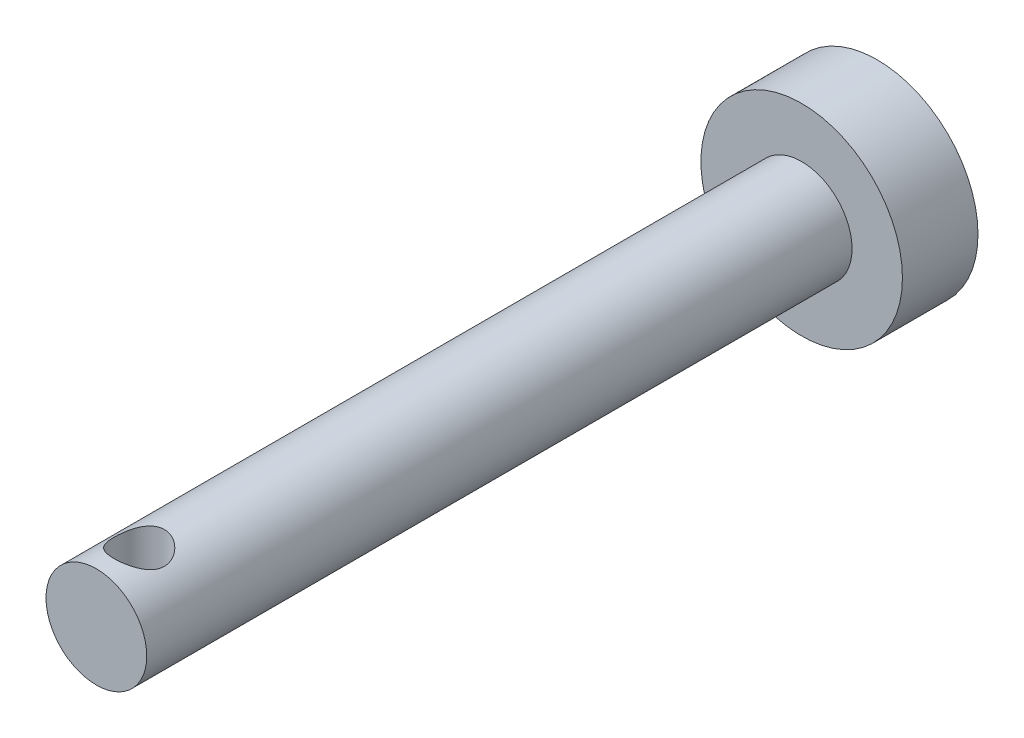
ISO-10303-21;
HEADER;
FILE_DESCRIPTION(('STEP AP214'),'2;1');
FILE_NAME('part.step','',(''),(''),'','','');
FILE_SCHEMA(('AUTOMOTIVE_DESIGN { 1 0 10303 214 1 1 1 1 }'));
ENDSEC;
DATA;
#1=APPLICATION_CONTEXT('core data for automotive mechanical design processes');
#2=APPLICATION_PROTOCOL_DEFINITION('international standard','automotive_design',2000,#1);
#3=PRODUCT_CONTEXT('',#1,'mechanical');
#4=PRODUCT('Part','Part','',(#3));
#5=PRODUCT_RELATED_PRODUCT_CATEGORY('part','',(#4));
#6=PRODUCT_DEFINITION_FORMATION('','',#4);
#7=PRODUCT_DEFINITION_CONTEXT('part definition',#1,'design');
#8=PRODUCT_DEFINITION('design','',#6,#7);
#9=PRODUCT_DEFINITION_SHAPE('','',#8);
#10=(LENGTH_UNIT() NAMED_UNIT(*) SI_UNIT(.MILLI.,.METRE.));
#11=(NAMED_UNIT(*) PLANE_ANGLE_UNIT() SI_UNIT($,.RADIAN.));
#12=(NAMED_UNIT(*) SI_UNIT($,.STERADIAN.) SOLID_ANGLE_UNIT());
#13=UNCERTAINTY_MEASURE_WITH_UNIT(LENGTH_MEASURE(1.E-05),#10,'distance_accuracy_value','');
#14=(GEOMETRIC_REPRESENTATION_CONTEXT(3) GLOBAL_UNCERTAINTY_ASSIGNED_CONTEXT((#13)) GLOBAL_UNIT_ASSIGNED_CONTEXT((#10,
#11,#12)) REPRESENTATION_CONTEXT('',''));
#15=CARTESIAN_POINT('',(0.,0.,0.));
#16=DIRECTION('',(0.,0.,1.));
#17=DIRECTION('',(1.,0.,0.));
#18=AXIS2_PLACEMENT_3D('',#15,#16,#17);
#19=CARTESIAN_POINT('',(0.,0.,-125.));
#20=DIRECTION('',(0.,0.,1.));
#21=DIRECTION('',(1.,0.,0.));
#22=AXIS2_PLACEMENT_3D('',#19,#20,#21);
#23=PLANE('',#22);
#24=CARTESIAN_POINT('',(0.,0.,-125.));
#25=DIRECTION('',(0.,0.,1.));
#26=DIRECTION('',(1.,0.,0.));
#27=AXIS2_PLACEMENT_3D('',#24,#25,#26);
#28=CIRCLE('',#27,4.);
#29=CARTESIAN_POINT('',(4.,0.,-125.));
#30=VERTEX_POINT('',#29);
#31=EDGE_CURVE('E10',#30,#30,#28,.T.);
#32=ORIENTED_EDGE('',*,*,#31,.F.);
#33=EDGE_LOOP('',(#32));
#34=FACE_BOUND('',#33,.T.);
#35=ADVANCED_FACE('F31',(#34),#23,.F.);
#36=CARTESIAN_POINT('',(0.,0.,125.));
#37=DIRECTION('',(0.,0.,1.));
#38=DIRECTION('',(1.,0.,0.));
#39=AXIS2_PLACEMENT_3D('',#36,#37,#38);
#40=CYLINDRICAL_SURFACE('',#39,4.);
#41=CARTESIAN_POINT('',(0.,0.,-122.));
#42=DIRECTION('',(0.,0.,1.));
#43=DIRECTION('',(1.,0.,0.));
#44=AXIS2_PLACEMENT_3D('',#41,#42,#43);
#45=CIRCLE('',#44,4.);
#46=CARTESIAN_POINT('',(4.,0.,-122.));
#47=VERTEX_POINT('',#46);
#48=EDGE_CURVE('E43',#47,#47,#45,.T.);
#49=ORIENTED_EDGE('',*,*,#48,.F.);
#50=EDGE_LOOP('',(#49));
#51=FACE_BOUND('',#50,.T.);
#52=ORIENTED_EDGE('',*,*,#31,.T.);
#53=EDGE_LOOP('',(#52));
#54=FACE_BOUND('',#53,.T.);
#55=ADVANCED_FACE('F79',(#51,#54),#40,.T.);
#56=CARTESIAN_POINT('',(0.,4.,-122.));
#57=DIRECTION('',(0.,0.,-1.));
#58=DIRECTION('',(-1.,0.,0.));
#59=AXIS2_PLACEMENT_3D('',#56,#57,#58);
#60=PLANE('',#59);
#61=CARTESIAN_POINT('',(0.,0.,-122.));
#62=DIRECTION('',(0.,0.,1.));
#63=DIRECTION('',(1.,0.,0.));
#64=AXIS2_PLACEMENT_3D('',#61,#62,#63);
#65=CIRCLE('',#64,2.00000000000003);
#66=CARTESIAN_POINT('',(2.00000000000003,0.,-122.));
#67=VERTEX_POINT('',#66);
#68=EDGE_CURVE('E48',#67,#67,#65,.T.);
#69=ORIENTED_EDGE('',*,*,#68,.F.);
#70=EDGE_LOOP('',(#69));
#71=FACE_BOUND('',#70,.T.);
#72=ORIENTED_EDGE('',*,*,#48,.T.);
#73=EDGE_LOOP('',(#72));
#74=FACE_BOUND('',#73,.T.);
#75=ADVANCED_FACE('F75',(#71,#74),#60,.F.);
#76=CARTESIAN_POINT('',(0.,0.,125.));
#77=DIRECTION('',(0.,0.,1.));
#78=DIRECTION('',(1.,0.,0.));
#79=AXIS2_PLACEMENT_3D('',#76,#77,#78);
#80=CYLINDRICAL_SURFACE('',#79,2.00000000000002);
#81=CARTESIAN_POINT('',(0.,-2.00000000000002,-94.7));
#82=CARTESIAN_POINT('',(0.0525719629529861,-1.99999713404152,-94.7000033023195));
#83=CARTESIAN_POINT('',(0.105206599698032,-1.99790491019519,-94.7041700731217));
#84=CARTESIAN_POINT('',(0.208920235268424,-1.98974156037398,-94.7206528803409));
#85=CARTESIAN_POINT('',(0.259996086713503,-1.98366287828985,-94.7329843929976));
#86=CARTESIAN_POINT('',(0.358933544880574,-1.96816279403313,-94.7651938086168));
#87=CARTESIAN_POINT('',(0.406806802939178,-1.95875439177522,-94.785042384248));
#88=CARTESIAN_POINT('',(0.498472616806563,-1.9374577651578,-94.8315706213649));
#89=CARTESIAN_POINT('',(0.542265493990048,-1.92556973633532,-94.8582497442489));
#90=CARTESIAN_POINT('',(0.62750781776192,-1.89956258258059,-94.9195172494853));
#91=CARTESIAN_POINT('',(0.668655211122115,-1.88535199127537,-94.9544864792396));
#92=CARTESIAN_POINT('',(0.744779444866981,-1.85659970246746,-95.030521479247));
#93=CARTESIAN_POINT('',(0.779751583106767,-1.84205776209037,-95.0715918517724));
#94=CARTESIAN_POINT('',(0.845252000450278,-1.81298951197349,-95.1624833495234));
#95=CARTESIAN_POINT('',(0.875225335551638,-1.79855186970133,-95.2127360983459));
#96=CARTESIAN_POINT('',(0.926168226890698,-1.77285978772322,-95.3183673359862));
#97=CARTESIAN_POINT('',(0.947144214966336,-1.76160307606991,-95.3737421287227));
#98=CARTESIAN_POINT('',(0.978132442188591,-1.7445786703781,-95.4846651054219));
#99=CARTESIAN_POINT('',(0.988725857080443,-1.73852271583715,-95.5400044520674));
#100=CARTESIAN_POINT('',(1.00042699330885,-1.73181889948529,-95.6519788377795));
#101=CARTESIAN_POINT('',(1.00154408837308,-1.7311656934329,-95.7086125408712));
#102=CARTESIAN_POINT('',(0.994687287172293,-1.7351093025725,-95.8142860243154));
#103=CARTESIAN_POINT('',(0.987784559536819,-1.73908763662015,-95.863424031223));
#104=CARTESIAN_POINT('',(0.966939849056931,-1.75076228733852,-95.959721909373));
#105=CARTESIAN_POINT('',(0.952995623897653,-1.75845978831778,-96.0068811453053));
#106=CARTESIAN_POINT('',(0.918209780386007,-1.77687476412743,-96.0992291325657));
#107=CARTESIAN_POINT('',(0.897215067115996,-1.78765840664,-96.1443463987858));
#108=CARTESIAN_POINT('',(0.849041687668001,-1.81103404281405,-96.23063429259));
#109=CARTESIAN_POINT('',(0.821860243812466,-1.82362684780192,-96.2718031356001));
#110=CARTESIAN_POINT('',(0.758066054912789,-1.85113157903287,-96.3545212527432));
#111=CARTESIAN_POINT('',(0.720694458369284,-1.86613510236748,-96.3954568735762));
#112=CARTESIAN_POINT('',(0.639555578741373,-1.89547623300409,-96.4707354185909));
#113=CARTESIAN_POINT('',(0.595785256574281,-1.90981351958803,-96.5050751920339));
#114=CARTESIAN_POINT('',(0.500516505831843,-1.93701987282966,-96.5676856610297));
#115=CARTESIAN_POINT('',(0.448753591599406,-1.94978984162009,-96.5956004724457));
#116=CARTESIAN_POINT('',(0.340466215488797,-1.97157881121244,-96.642097029043));
#117=CARTESIAN_POINT('',(0.283945576265277,-1.98060078943554,-96.6606861850152));
#118=CARTESIAN_POINT('',(0.172766491660702,-1.99324333741438,-96.6864754037167));
#119=CARTESIAN_POINT('',(0.118341530548324,-1.99724938301313,-96.6944912357468));
#120=CARTESIAN_POINT('',(0.00877959994935263,-2.00073013459103,-96.7014647311345));
#121=CARTESIAN_POINT('',(-0.0463570198699035,-2.00020698721314,-96.7004266856395));
#122=CARTESIAN_POINT('',(-0.151232971985996,-1.99491192253442,-96.6897933115812));
#123=CARTESIAN_POINT('',(-0.201059408049955,-1.99047245688191,-96.68086746727));
#124=CARTESIAN_POINT('',(-0.298406892301917,-1.9782217131482,-96.6557619281049));
#125=CARTESIAN_POINT('',(-0.345927685690998,-1.97041006334334,-96.6395814335466));
#126=CARTESIAN_POINT('',(-0.438888608449671,-1.95184251413671,-96.6000015335668));
#127=CARTESIAN_POINT('',(-0.484230397006162,-1.94100881769941,-96.5764089498832));
#128=CARTESIAN_POINT('',(-0.570461361698928,-1.9174397431711,-96.5228924643539));
#129=CARTESIAN_POINT('',(-0.611348629775286,-1.90470355565787,-96.4929658654066));
#130=CARTESIAN_POINT('',(-0.691767689290655,-1.87708221337466,-96.4242395746671));
#131=CARTESIAN_POINT('',(-0.730772077824641,-1.86210884848443,-96.3848571315464));
#132=CARTESIAN_POINT('',(-0.801856321113242,-1.83262391603876,-96.3000748487307));
#133=CARTESIAN_POINT('',(-0.833931385690844,-1.81811267381528,-96.2546708811836));
#134=CARTESIAN_POINT('',(-0.891707914497697,-1.7905119222607,-96.1563563457997));
#135=CARTESIAN_POINT('',(-0.917025495878638,-1.77752529663474,-96.1031887337914));
#136=CARTESIAN_POINT('',(-0.958082826013803,-1.75574072368128,-95.9924899323075));
#137=CARTESIAN_POINT('',(-0.97383491588757,-1.7469373824062,-95.9349644734988));
#138=CARTESIAN_POINT('',(-0.993861687449679,-1.73561501008669,-95.8230897771385));
#139=CARTESIAN_POINT('',(-0.999092996400865,-1.73257383460493,-95.768965746571));
#140=CARTESIAN_POINT('',(-1.00068915438079,-1.73165354646177,-95.6605529328293));
#141=CARTESIAN_POINT('',(-0.9970578466244,-1.73377219627554,-95.6062642312606));
#142=CARTESIAN_POINT('',(-0.981926125592264,-1.74237862050026,-95.504516498468));
#143=CARTESIAN_POINT('',(-0.9712083143428,-1.74843094482395,-95.4568995298556));
#144=CARTESIAN_POINT('',(-0.943175358224643,-1.76371016187919,-95.3641918805753));
#145=CARTESIAN_POINT('',(-0.925858091159808,-1.77293807569677,-95.319102017908));
#146=CARTESIAN_POINT('',(-0.88381574530068,-1.7942853036453,-95.2293751490134));
#147=CARTESIAN_POINT('',(-0.858671137816454,-1.80655722396193,-95.1849720981703));
#148=CARTESIAN_POINT('',(-0.802150971636628,-1.83235331634592,-95.1007254638194));
#149=CARTESIAN_POINT('',(-0.77077217123864,-1.84587813794524,-95.0608842694815));
#150=CARTESIAN_POINT('',(-0.698203326664633,-1.87462323159315,-94.9818580176424));
#151=CARTESIAN_POINT('',(-0.656284423010165,-1.8898498331147,-94.9433408976381));
#152=CARTESIAN_POINT('',(-0.566154806220276,-1.91877752255089,-94.8737370165764));
#153=CARTESIAN_POINT('',(-0.517940723256782,-1.93247778608042,-94.8426542605737));
#154=CARTESIAN_POINT('',(-0.415931596819944,-1.95698009585105,-94.7887636372378));
#155=CARTESIAN_POINT('',(-0.362099503934612,-1.96776096562911,-94.7660158305886));
#156=CARTESIAN_POINT('',(-0.250742101294191,-1.98501341363467,-94.730191832081));
#157=CARTESIAN_POINT('',(-0.193227799623167,-1.99149723372934,-94.7170881531704));
#158=CARTESIAN_POINT('',(-0.112601946483385,-1.99695461909665,-94.7061025889241));
#159=CARTESIAN_POINT('',(-0.0901618794395,-1.99809365339203,-94.7038173591364));
#160=CARTESIAN_POINT('',(-0.0451517318071583,-1.99961696977866,-94.7007653344832));
#161=CARTESIAN_POINT('',(-0.0225816476473817,-2.00000123103765,-94.6999985815288));
#162=CARTESIAN_POINT('',(0.,-2.00000000000002,-94.7));
#163=B_SPLINE_CURVE_WITH_KNOTS('',3,(#81,#82,#83,#84,#85,#86,#87,#88,#89,#90,#91,#92,#93,#94,
#95,#96,#97,#98,#99,#100,#101,#102,#103,#104,#105,#106,#107,#108,#109,#110,#111,#112,#113,#114,
#115,#116,#117,#118,#119,#120,#121,#122,#123,#124,#125,#126,#127,#128,#129,#130,#131,#132,#133,
#134,#135,#136,#137,#138,#139,#140,#141,#142,#143,#144,#145,#146,#147,#148,#149,#150,#151,#152,
#153,#154,#155,#156,#157,#158,#159,#160,#161,#162),.UNSPECIFIED.,.T.,.F.,(4,2,2,2,2,2,2,2,2,2,2,
2,2,2,2,2,2,2,2,2,2,2,2,2,2,2,2,2,2,2,2,2,2,2,2,2,2,2,2,2,4),(0.,0.157624257420292,
0.315548149709195,0.472862155492292,0.630163760581568,0.796981758718097,0.96392623765404,
1.14381726430753,1.32357947898281,1.4925801214023,1.66141357329022,1.81005712409322,
1.95874803925679,2.11090240168488,2.26312521260222,2.43464941333879,2.60625534598687,
2.78583022214441,2.9652621691228,3.12983290471346,3.29432564511476,3.44606906506122,
3.59782921630932,3.753928560279,3.91009450748339,4.08159610644419,4.25321588615433,
4.43314682159675,4.61284511940778,4.77529307498373,4.93767059860005,5.08457930244184,
5.23153528783679,5.38836456775616,5.54527561138959,5.721252427525,5.89732383376574,
6.07464013662926,6.2514490862493,6.31915280137698,6.38685838514847),.UNSPECIFIED.);
#164=CARTESIAN_POINT('',(0.,-2.00000000000002,-94.7));
#165=VERTEX_POINT('',#164);
#166=EDGE_CURVE('E34',#165,#165,#163,.T.);
#167=ORIENTED_EDGE('',*,*,#166,.T.);
#168=EDGE_LOOP('',(#167));
#169=FACE_BOUND('',#168,.T.);
#170=CARTESIAN_POINT('',(0.,2.00000000000002,-94.7));
#171=CARTESIAN_POINT('',(-0.0525719629529861,1.99999713404152,-94.7000033023195));
#172=CARTESIAN_POINT('',(-0.105206599698032,1.99790491019519,-94.7041700731217));
#173=CARTESIAN_POINT('',(-0.208920235268424,1.98974156037398,-94.7206528803409));
#174=CARTESIAN_POINT('',(-0.259996086713503,1.98366287828985,-94.7329843929976));
#175=CARTESIAN_POINT('',(-0.358933544880574,1.96816279403313,-94.7651938086168));
#176=CARTESIAN_POINT('',(-0.406806802939178,1.95875439177522,-94.785042384248));
#177=CARTESIAN_POINT('',(-0.498472616806563,1.9374577651578,-94.8315706213649));
#178=CARTESIAN_POINT('',(-0.542265493990048,1.92556973633532,-94.8582497442489));
#179=CARTESIAN_POINT('',(-0.62750781776192,1.89956258258059,-94.9195172494853));
#180=CARTESIAN_POINT('',(-0.668655211122115,1.88535199127537,-94.9544864792396));
#181=CARTESIAN_POINT('',(-0.744779444866981,1.85659970246746,-95.030521479247));
#182=CARTESIAN_POINT('',(-0.779751583106767,1.84205776209037,-95.0715918517724));
#183=CARTESIAN_POINT('',(-0.845252000450278,1.81298951197349,-95.1624833495234));
#184=CARTESIAN_POINT('',(-0.875225335551638,1.79855186970133,-95.2127360983459));
#185=CARTESIAN_POINT('',(-0.926168226890698,1.77285978772322,-95.3183673359862));
#186=CARTESIAN_POINT('',(-0.947144214966336,1.76160307606991,-95.3737421287227));
#187=CARTESIAN_POINT('',(-0.978132442188591,1.7445786703781,-95.4846651054219));
#188=CARTESIAN_POINT('',(-0.988725857080443,1.73852271583715,-95.5400044520674));
#189=CARTESIAN_POINT('',(-1.00042699330885,1.73181889948529,-95.6519788377795));
#190=CARTESIAN_POINT('',(-1.00154408837308,1.7311656934329,-95.7086125408712));
#191=CARTESIAN_POINT('',(-0.994687287172293,1.7351093025725,-95.8142860243154));
#192=CARTESIAN_POINT('',(-0.987784559536819,1.73908763662015,-95.863424031223));
#193=CARTESIAN_POINT('',(-0.966939849056931,1.75076228733852,-95.959721909373));
#194=CARTESIAN_POINT('',(-0.952995623897653,1.75845978831778,-96.0068811453053));
#195=CARTESIAN_POINT('',(-0.918209780386007,1.77687476412743,-96.0992291325657));
#196=CARTESIAN_POINT('',(-0.897215067115996,1.78765840664,-96.1443463987858));
#197=CARTESIAN_POINT('',(-0.849041687668001,1.81103404281405,-96.23063429259));
#198=CARTESIAN_POINT('',(-0.821860243812466,1.82362684780192,-96.2718031356001));
#199=CARTESIAN_POINT('',(-0.758066054912789,1.85113157903287,-96.3545212527432));
#200=CARTESIAN_POINT('',(-0.720694458369284,1.86613510236748,-96.3954568735762));
#201=CARTESIAN_POINT('',(-0.639555578741373,1.89547623300409,-96.4707354185909));
#202=CARTESIAN_POINT('',(-0.595785256574281,1.90981351958803,-96.5050751920339));
#203=CARTESIAN_POINT('',(-0.500516505831843,1.93701987282966,-96.5676856610297));
#204=CARTESIAN_POINT('',(-0.448753591599406,1.94978984162009,-96.5956004724457));
#205=CARTESIAN_POINT('',(-0.340466215488797,1.97157881121244,-96.642097029043));
#206=CARTESIAN_POINT('',(-0.283945576265277,1.98060078943554,-96.6606861850152));
#207=CARTESIAN_POINT('',(-0.172766491660702,1.99324333741438,-96.6864754037167));
#208=CARTESIAN_POINT('',(-0.118341530548324,1.99724938301313,-96.6944912357468));
#209=CARTESIAN_POINT('',(-0.00877959994935263,2.00073013459103,-96.7014647311345));
#210=CARTESIAN_POINT('',(0.0463570198699035,2.00020698721314,-96.7004266856395));
#211=CARTESIAN_POINT('',(0.151232971985996,1.99491192253442,-96.6897933115812));
#212=CARTESIAN_POINT('',(0.201059408049955,1.99047245688191,-96.68086746727));
#213=CARTESIAN_POINT('',(0.298406892301917,1.9782217131482,-96.6557619281049));
#214=CARTESIAN_POINT('',(0.345927685690998,1.97041006334334,-96.6395814335466));
#215=CARTESIAN_POINT('',(0.438888608449671,1.95184251413671,-96.6000015335668));
#216=CARTESIAN_POINT('',(0.484230397006162,1.94100881769941,-96.5764089498832));
#217=CARTESIAN_POINT('',(0.570461361698928,1.9174397431711,-96.5228924643539));
#218=CARTESIAN_POINT('',(0.611348629775286,1.90470355565787,-96.4929658654066));
#219=CARTESIAN_POINT('',(0.691767689290655,1.87708221337466,-96.4242395746671));
#220=CARTESIAN_POINT('',(0.730772077824641,1.86210884848443,-96.3848571315464));
#221=CARTESIAN_POINT('',(0.801856321113242,1.83262391603876,-96.3000748487307));
#222=CARTESIAN_POINT('',(0.833931385690844,1.81811267381528,-96.2546708811836));
#223=CARTESIAN_POINT('',(0.891707914497697,1.7905119222607,-96.1563563457997));
#224=CARTESIAN_POINT('',(0.917025495878638,1.77752529663474,-96.1031887337914));
#225=CARTESIAN_POINT('',(0.958082826013803,1.75574072368128,-95.9924899323075));
#226=CARTESIAN_POINT('',(0.97383491588757,1.7469373824062,-95.9349644734988));
#227=CARTESIAN_POINT('',(0.993861687449679,1.73561501008669,-95.8230897771385));
#228=CARTESIAN_POINT('',(0.999092996400865,1.73257383460493,-95.768965746571));
#229=CARTESIAN_POINT('',(1.00068915438079,1.73165354646177,-95.6605529328293));
#230=CARTESIAN_POINT('',(0.9970578466244,1.73377219627554,-95.6062642312606));
#231=CARTESIAN_POINT('',(0.981926125592264,1.74237862050026,-95.504516498468));
#232=CARTESIAN_POINT('',(0.9712083143428,1.74843094482395,-95.4568995298556));
#233=CARTESIAN_POINT('',(0.943175358224643,1.76371016187919,-95.3641918805753));
#234=CARTESIAN_POINT('',(0.925858091159808,1.77293807569677,-95.319102017908));
#235=CARTESIAN_POINT('',(0.88381574530068,1.7942853036453,-95.2293751490134));
#236=CARTESIAN_POINT('',(0.858671137816454,1.80655722396193,-95.1849720981703));
#237=CARTESIAN_POINT('',(0.802150971636628,1.83235331634592,-95.1007254638194));
#238=CARTESIAN_POINT('',(0.77077217123864,1.84587813794524,-95.0608842694815));
#239=CARTESIAN_POINT('',(0.698203326664633,1.87462323159315,-94.9818580176424));
#240=CARTESIAN_POINT('',(0.656284423010165,1.8898498331147,-94.9433408976381));
#241=CARTESIAN_POINT('',(0.566154806220276,1.91877752255089,-94.8737370165764));
#242=CARTESIAN_POINT('',(0.517940723256782,1.93247778608042,-94.8426542605737));
#243=CARTESIAN_POINT('',(0.415931596819944,1.95698009585105,-94.7887636372378));
#244=CARTESIAN_POINT('',(0.362099503934612,1.96776096562911,-94.7660158305886));
#245=CARTESIAN_POINT('',(0.250742101294191,1.98501341363467,-94.730191832081));
#246=CARTESIAN_POINT('',(0.193227799623167,1.99149723372934,-94.7170881531704));
#247=CARTESIAN_POINT('',(0.112601946483385,1.99695461909665,-94.7061025889241));
#248=CARTESIAN_POINT('',(0.0901618794395,1.99809365339203,-94.7038173591364));
#249=CARTESIAN_POINT('',(0.0451517318071583,1.99961696977866,-94.7007653344832));
#250=CARTESIAN_POINT('',(0.0225816476473817,2.00000123103765,-94.6999985815288));
#251=CARTESIAN_POINT('',(0.,2.00000000000002,-94.7));
#252=B_SPLINE_CURVE_WITH_KNOTS('',3,(#170,#171,#172,#173,#174,#175,#176,#177,#178,#179,#180,
#181,#182,#183,#184,#185,#186,#187,#188,#189,#190,#191,#192,#193,#194,#195,#196,#197,#198,#199,
#200,#201,#202,#203,#204,#205,#206,#207,#208,#209,#210,#211,#212,#213,#214,#215,#216,#217,#218,
#219,#220,#221,#222,#223,#224,#225,#226,#227,#228,#229,#230,#231,#232,#233,#234,#235,#236,#237,
#238,#239,#240,#241,#242,#243,#244,#245,#246,#247,#248,#249,#250,#251),.UNSPECIFIED.,.T.,.F.,(4,
2,2,2,2,2,2,2,2,2,2,2,2,2,2,2,2,2,2,2,2,2,2,2,2,2,2,2,2,2,2,2,2,2,2,2,2,2,2,2,4),(0.,
0.157624257420292,0.315548149709195,0.472862155492292,0.630163760581568,0.796981758718097,
0.96392623765404,1.14381726430753,1.32357947898281,1.4925801214023,1.66141357329022,
1.81005712409322,1.95874803925679,2.11090240168488,2.26312521260222,2.43464941333879,
2.60625534598687,2.78583022214441,2.9652621691228,3.12983290471346,3.29432564511476,
3.44606906506122,3.59782921630932,3.753928560279,3.91009450748339,4.08159610644419,
4.25321588615433,4.43314682159675,4.61284511940778,4.77529307498373,4.93767059860005,
5.08457930244184,5.23153528783679,5.38836456775616,5.54527561138959,5.721252427525,
5.89732383376574,6.07464013662926,6.2514490862493,6.31915280137698,6.38685838514847),.UNSPECIFIED.);
#253=CARTESIAN_POINT('',(0.,2.00000000000002,-94.7));
#254=VERTEX_POINT('',#253);
#255=EDGE_CURVE('E54',#254,#254,#252,.T.);
#256=ORIENTED_EDGE('',*,*,#255,.T.);
#257=EDGE_LOOP('',(#256));
#258=FACE_BOUND('',#257,.T.);
#259=CARTESIAN_POINT('',(0.,0.,-94.));
#260=DIRECTION('',(0.,0.,-1.));
#261=DIRECTION('',(-1.,0.,0.));
#262=AXIS2_PLACEMENT_3D('',#259,#260,#261);
#263=CIRCLE('',#262,2.00000000000002);
#264=CARTESIAN_POINT('',(-2.00000000000002,0.,-94.));
#265=VERTEX_POINT('',#264);
#266=EDGE_CURVE('E52',#265,#265,#263,.T.);
#267=ORIENTED_EDGE('',*,*,#266,.T.);
#268=EDGE_LOOP('',(#267));
#269=FACE_BOUND('',#268,.T.);
#270=ORIENTED_EDGE('',*,*,#68,.T.);
#271=EDGE_LOOP('',(#270));
#272=FACE_BOUND('',#271,.T.);
#273=ADVANCED_FACE('F59',(#169,#258,#269,#272),#80,.T.);
#274=CARTESIAN_POINT('',(-4.,4.06732485631839,-94.));
#275=DIRECTION('',(0.,0.,-1.));
#276=DIRECTION('',(-1.,0.,0.));
#277=AXIS2_PLACEMENT_3D('',#274,#275,#276);
#278=PLANE('',#277);
#279=ORIENTED_EDGE('',*,*,#266,.F.);
#280=EDGE_LOOP('',(#279));
#281=FACE_BOUND('',#280,.T.);
#282=ADVANCED_FACE('F66',(#281),#278,.F.);
#283=CARTESIAN_POINT('',(0.,-4.,-95.7));
#284=DIRECTION('',(0.,1.,0.));
#285=DIRECTION('',(0.,0.,1.));
#286=AXIS2_PLACEMENT_3D('',#283,#284,#285);
#287=CYLINDRICAL_SURFACE('',#286,1.);
#288=ORIENTED_EDGE('',*,*,#255,.F.);
#289=EDGE_LOOP('',(#288));
#290=FACE_BOUND('',#289,.T.);
#291=ORIENTED_EDGE('',*,*,#166,.F.);
#292=EDGE_LOOP('',(#291));
#293=FACE_BOUND('',#292,.T.);
#294=ADVANCED_FACE('F63',(#290,#293),#287,.F.);
#295=CLOSED_SHELL('',(#35,#55,#75,#273,#282,#294));
#296=MANIFOLD_SOLID_BREP('B2',#295);
#297=ADVANCED_BREP_SHAPE_REPRESENTATION('',(#18,#296),#14);
#298=SHAPE_DEFINITION_REPRESENTATION(#9,#297);
ENDSEC;
END-ISO-10303-21;
